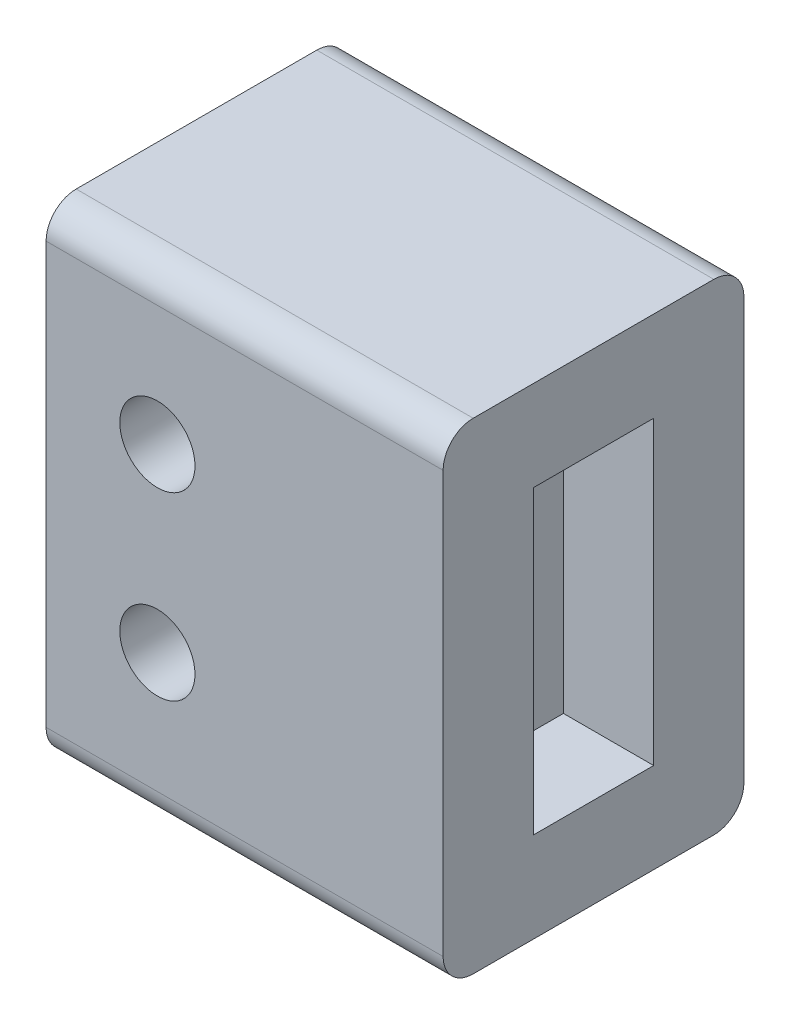
ISO-10303-21;
HEADER;
FILE_DESCRIPTION(('STEP AP214'),'2;1');
FILE_NAME('part.step','',(''),(''),'','','');
FILE_SCHEMA(('AUTOMOTIVE_DESIGN { 1 0 10303 214 1 1 1 1 }'));
ENDSEC;
DATA;
#1=APPLICATION_CONTEXT('core data for automotive mechanical design processes');
#2=APPLICATION_PROTOCOL_DEFINITION('international standard','automotive_design',2000,#1);
#3=PRODUCT_CONTEXT('',#1,'mechanical');
#4=PRODUCT('Part','Part','',(#3));
#5=PRODUCT_RELATED_PRODUCT_CATEGORY('part','',(#4));
#6=PRODUCT_DEFINITION_FORMATION('','',#4);
#7=PRODUCT_DEFINITION_CONTEXT('part definition',#1,'design');
#8=PRODUCT_DEFINITION('design','',#6,#7);
#9=PRODUCT_DEFINITION_SHAPE('','',#8);
#10=(LENGTH_UNIT() NAMED_UNIT(*) SI_UNIT(.MILLI.,.METRE.));
#11=(NAMED_UNIT(*) PLANE_ANGLE_UNIT() SI_UNIT($,.RADIAN.));
#12=(NAMED_UNIT(*) SI_UNIT($,.STERADIAN.) SOLID_ANGLE_UNIT());
#13=UNCERTAINTY_MEASURE_WITH_UNIT(LENGTH_MEASURE(1.E-05),#10,'distance_accuracy_value','');
#14=(GEOMETRIC_REPRESENTATION_CONTEXT(3) GLOBAL_UNCERTAINTY_ASSIGNED_CONTEXT((#13)) GLOBAL_UNIT_ASSIGNED_CONTEXT((#10,
#11,#12)) REPRESENTATION_CONTEXT('',''));
#15=CARTESIAN_POINT('',(0.,0.,0.));
#16=DIRECTION('',(0.,0.,1.));
#17=DIRECTION('',(1.,0.,0.));
#18=AXIS2_PLACEMENT_3D('',#15,#16,#17);
#19=CARTESIAN_POINT('',(16.3,6.,6.));
#20=DIRECTION('',(1.,0.,0.));
#21=DIRECTION('',(0.,0.,-1.));
#22=AXIS2_PLACEMENT_3D('',#19,#20,#21);
#23=PLANE('',#22);
#24=DIRECTION('',(0.,-1.,0.));
#25=VECTOR('',#24,1.);
#26=CARTESIAN_POINT('',(16.3,6.,-2.));
#27=LINE('',#26,#25);
#28=CARTESIAN_POINT('',(16.3,7.,-2.));
#29=VERTEX_POINT('',#28);
#30=CARTESIAN_POINT('',(16.3,-7.,-2.));
#31=VERTEX_POINT('',#30);
#32=EDGE_CURVE('E258',#29,#31,#27,.T.);
#33=ORIENTED_EDGE('',*,*,#32,.T.);
#34=CARTESIAN_POINT('',(16.3,-7.,-1.));
#35=DIRECTION('',(1.,0.,0.));
#36=DIRECTION('',(0.,0.,-1.));
#37=AXIS2_PLACEMENT_3D('',#34,#35,#36);
#38=CIRCLE('',#37,1.);
#39=CARTESIAN_POINT('',(16.3,-8.,-1.));
#40=VERTEX_POINT('',#39);
#41=EDGE_CURVE('E294',#31,#40,#38,.F.);
#42=ORIENTED_EDGE('',*,*,#41,.T.);
#43=DIRECTION('',(0.,0.,-1.));
#44=VECTOR('',#43,1.);
#45=CARTESIAN_POINT('',(16.3,-8.,6.));
#46=LINE('',#45,#44);
#47=CARTESIAN_POINT('',(16.3,-8.,7.));
#48=VERTEX_POINT('',#47);
#49=EDGE_CURVE('E262',#48,#40,#46,.T.);
#50=ORIENTED_EDGE('',*,*,#49,.F.);
#51=CARTESIAN_POINT('',(16.3,-7.,7.));
#52=DIRECTION('',(1.,0.,0.));
#53=DIRECTION('',(0.,0.,-1.));
#54=AXIS2_PLACEMENT_3D('',#51,#52,#53);
#55=CIRCLE('',#54,1.);
#56=CARTESIAN_POINT('',(16.3,-7.,8.));
#57=VERTEX_POINT('',#56);
#58=EDGE_CURVE('E292',#48,#57,#55,.F.);
#59=ORIENTED_EDGE('',*,*,#58,.T.);
#60=DIRECTION('',(0.,-1.,0.));
#61=VECTOR('',#60,1.);
#62=CARTESIAN_POINT('',(16.3,6.,8.));
#63=LINE('',#62,#61);
#64=CARTESIAN_POINT('',(16.3,7.,8.));
#65=VERTEX_POINT('',#64);
#66=EDGE_CURVE('E265',#65,#57,#63,.T.);
#67=ORIENTED_EDGE('',*,*,#66,.F.);
#68=CARTESIAN_POINT('',(16.3,7.,7.));
#69=DIRECTION('',(1.,0.,0.));
#70=DIRECTION('',(0.,0.,-1.));
#71=AXIS2_PLACEMENT_3D('',#68,#69,#70);
#72=CIRCLE('',#71,1.);
#73=CARTESIAN_POINT('',(16.3,8.,7.));
#74=VERTEX_POINT('',#73);
#75=EDGE_CURVE('E62',#65,#74,#72,.F.);
#76=ORIENTED_EDGE('',*,*,#75,.T.);
#77=DIRECTION('',(0.,0.,-1.));
#78=VECTOR('',#77,1.);
#79=CARTESIAN_POINT('',(16.3,8.,6.));
#80=LINE('',#79,#78);
#81=CARTESIAN_POINT('',(16.3,8.,-1.));
#82=VERTEX_POINT('',#81);
#83=EDGE_CURVE('E259',#74,#82,#80,.T.);
#84=ORIENTED_EDGE('',*,*,#83,.T.);
#85=CARTESIAN_POINT('',(16.3,7.,-1.));
#86=DIRECTION('',(1.,0.,0.));
#87=DIRECTION('',(0.,0.,-1.));
#88=AXIS2_PLACEMENT_3D('',#85,#86,#87);
#89=CIRCLE('',#88,1.);
#90=EDGE_CURVE('E54',#82,#29,#89,.F.);
#91=ORIENTED_EDGE('',*,*,#90,.T.);
#92=EDGE_LOOP('',(#33,#42,#50,#59,#67,#76,#84,#91));
#93=FACE_BOUND('',#92,.T.);
#94=DIRECTION('',(0.,-1.,0.));
#95=VECTOR('',#94,1.);
#96=CARTESIAN_POINT('',(16.3,6.,0.));
#97=LINE('',#96,#95);
#98=CARTESIAN_POINT('',(16.3,6.,0.));
#99=VERTEX_POINT('',#98);
#100=CARTESIAN_POINT('',(16.3,-6.,0.));
#101=VERTEX_POINT('',#100);
#102=EDGE_CURVE('E244',#99,#101,#97,.T.);
#103=ORIENTED_EDGE('',*,*,#102,.F.);
#104=DIRECTION('',(0.,0.,-1.));
#105=VECTOR('',#104,1.);
#106=CARTESIAN_POINT('',(16.3,6.,6.));
#107=LINE('',#106,#105);
#108=CARTESIAN_POINT('',(16.3,6.,6.));
#109=VERTEX_POINT('',#108);
#110=EDGE_CURVE('E252',#109,#99,#107,.T.);
#111=ORIENTED_EDGE('',*,*,#110,.F.);
#112=DIRECTION('',(0.,-1.,0.));
#113=VECTOR('',#112,1.);
#114=CARTESIAN_POINT('',(16.3,6.,6.));
#115=LINE('',#114,#113);
#116=CARTESIAN_POINT('',(16.3,-6.,6.));
#117=VERTEX_POINT('',#116);
#118=EDGE_CURVE('E234',#109,#117,#115,.T.);
#119=ORIENTED_EDGE('',*,*,#118,.T.);
#120=DIRECTION('',(0.,0.,-1.));
#121=VECTOR('',#120,1.);
#122=CARTESIAN_POINT('',(16.3,-6.,6.));
#123=LINE('',#122,#121);
#124=EDGE_CURVE('E249',#117,#101,#123,.T.);
#125=ORIENTED_EDGE('',*,*,#124,.T.);
#126=EDGE_LOOP('',(#103,#111,#119,#125));
#127=FACE_BOUND('',#126,.T.);
#128=ADVANCED_FACE('F39',(#93,#127),#23,.F.);
#129=CARTESIAN_POINT('',(23.5,8.,6.));
#130=DIRECTION('',(0.,-1.,0.));
#131=DIRECTION('',(1.,0.,0.));
#132=AXIS2_PLACEMENT_3D('',#129,#130,#131);
#133=PLANE('',#132);
#134=ORIENTED_EDGE('',*,*,#83,.F.);
#135=DIRECTION('',(-1.,0.,0.));
#136=VECTOR('',#135,1.);
#137=CARTESIAN_POINT('',(29.5,8.,7.));
#138=LINE('',#137,#136);
#139=CARTESIAN_POINT('',(29.5,8.,7.));
#140=VERTEX_POINT('',#139);
#141=EDGE_CURVE('E11',#74,#140,#138,.F.);
#142=ORIENTED_EDGE('',*,*,#141,.T.);
#143=DIRECTION('',(0.,0.,1.));
#144=VECTOR('',#143,1.);
#145=CARTESIAN_POINT('',(29.5,8.,8.));
#146=LINE('',#145,#144);
#147=CARTESIAN_POINT('',(29.5,8.,-1.));
#148=VERTEX_POINT('',#147);
#149=EDGE_CURVE('E203',#148,#140,#146,.T.);
#150=ORIENTED_EDGE('',*,*,#149,.F.);
#151=DIRECTION('',(-1.,0.,0.));
#152=VECTOR('',#151,1.);
#153=CARTESIAN_POINT('',(23.5,8.,-1.));
#154=LINE('',#153,#152);
#155=EDGE_CURVE('E47',#148,#82,#154,.T.);
#156=ORIENTED_EDGE('',*,*,#155,.T.);
#157=EDGE_LOOP('',(#134,#142,#150,#156));
#158=FACE_BOUND('',#157,.T.);
#159=ADVANCED_FACE('F303',(#158),#133,.F.);
#160=CARTESIAN_POINT('',(16.3,-8.,6.));
#161=DIRECTION('',(0.,1.,0.));
#162=DIRECTION('',(-1.,0.,0.));
#163=AXIS2_PLACEMENT_3D('',#160,#161,#162);
#164=PLANE('',#163);
#165=ORIENTED_EDGE('',*,*,#49,.T.);
#166=DIRECTION('',(1.,0.,0.));
#167=VECTOR('',#166,1.);
#168=CARTESIAN_POINT('',(16.3,-8.,-1.));
#169=LINE('',#168,#167);
#170=CARTESIAN_POINT('',(29.5,-8.,-1.));
#171=VERTEX_POINT('',#170);
#172=EDGE_CURVE('E275',#40,#171,#169,.T.);
#173=ORIENTED_EDGE('',*,*,#172,.T.);
#174=DIRECTION('',(0.,0.,-1.));
#175=VECTOR('',#174,1.);
#176=CARTESIAN_POINT('',(29.5,-8.,8.));
#177=LINE('',#176,#175);
#178=CARTESIAN_POINT('',(29.5,-8.,7.));
#179=VERTEX_POINT('',#178);
#180=EDGE_CURVE('E197',#179,#171,#177,.T.);
#181=ORIENTED_EDGE('',*,*,#180,.F.);
#182=DIRECTION('',(1.,0.,0.));
#183=VECTOR('',#182,1.);
#184=CARTESIAN_POINT('',(16.3,-8.,7.));
#185=LINE('',#184,#183);
#186=EDGE_CURVE('E261',#179,#48,#185,.F.);
#187=ORIENTED_EDGE('',*,*,#186,.T.);
#188=EDGE_LOOP('',(#165,#173,#181,#187));
#189=FACE_BOUND('',#188,.T.);
#190=ADVANCED_FACE('F320',(#189),#164,.F.);
#191=CARTESIAN_POINT('',(0.,0.,8.));
#192=DIRECTION('',(0.,0.,1.));
#193=DIRECTION('',(1.,0.,0.));
#194=AXIS2_PLACEMENT_3D('',#191,#192,#193);
#195=PLANE('',#194);
#196=CARTESIAN_POINT('',(20.,-3.,8.));
#197=DIRECTION('',(0.,0.,1.));
#198=DIRECTION('',(1.,0.,0.));
#199=AXIS2_PLACEMENT_3D('',#196,#197,#198);
#200=CIRCLE('',#199,1.25);
#201=CARTESIAN_POINT('',(21.25,-3.,8.));
#202=VERTEX_POINT('',#201);
#203=EDGE_CURVE('E207',#202,#202,#200,.T.);
#204=ORIENTED_EDGE('',*,*,#203,.F.);
#205=EDGE_LOOP('',(#204));
#206=FACE_BOUND('',#205,.T.);
#207=CARTESIAN_POINT('',(20.,3.,8.));
#208=DIRECTION('',(0.,0.,1.));
#209=DIRECTION('',(1.,0.,0.));
#210=AXIS2_PLACEMENT_3D('',#207,#208,#209);
#211=CIRCLE('',#210,1.25);
#212=CARTESIAN_POINT('',(21.25,3.,8.));
#213=VERTEX_POINT('',#212);
#214=EDGE_CURVE('E206',#213,#213,#211,.T.);
#215=ORIENTED_EDGE('',*,*,#214,.F.);
#216=EDGE_LOOP('',(#215));
#217=FACE_BOUND('',#216,.T.);
#218=ORIENTED_EDGE('',*,*,#66,.T.);
#219=DIRECTION('',(1.,0.,0.));
#220=VECTOR('',#219,1.);
#221=CARTESIAN_POINT('',(29.5,-7.,8.));
#222=LINE('',#221,#220);
#223=CARTESIAN_POINT('',(29.5,-7.,8.));
#224=VERTEX_POINT('',#223);
#225=EDGE_CURVE('E299',#57,#224,#222,.T.);
#226=ORIENTED_EDGE('',*,*,#225,.T.);
#227=DIRECTION('',(0.,-1.,0.));
#228=VECTOR('',#227,1.);
#229=CARTESIAN_POINT('',(29.5,8.,8.));
#230=LINE('',#229,#228);
#231=CARTESIAN_POINT('',(29.5,7.,8.));
#232=VERTEX_POINT('',#231);
#233=EDGE_CURVE('E194',#232,#224,#230,.T.);
#234=ORIENTED_EDGE('',*,*,#233,.F.);
#235=DIRECTION('',(-1.,0.,0.));
#236=VECTOR('',#235,1.);
#237=CARTESIAN_POINT('',(16.3,7.,8.));
#238=LINE('',#237,#236);
#239=EDGE_CURVE('E296',#232,#65,#238,.T.);
#240=ORIENTED_EDGE('',*,*,#239,.T.);
#241=EDGE_LOOP('',(#218,#226,#234,#240));
#242=FACE_BOUND('',#241,.T.);
#243=ADVANCED_FACE('F327',(#206,#217,#242),#195,.T.);
#244=CARTESIAN_POINT('',(0.,0.,-2.));
#245=DIRECTION('',(0.,0.,1.));
#246=DIRECTION('',(1.,0.,0.));
#247=AXIS2_PLACEMENT_3D('',#244,#245,#246);
#248=PLANE('',#247);
#249=CARTESIAN_POINT('',(20.,-3.,-2.));
#250=DIRECTION('',(0.,0.,1.));
#251=DIRECTION('',(1.,0.,0.));
#252=AXIS2_PLACEMENT_3D('',#249,#250,#251);
#253=CIRCLE('',#252,1.25);
#254=CARTESIAN_POINT('',(21.25,-3.,-2.));
#255=VERTEX_POINT('',#254);
#256=EDGE_CURVE('E210',#255,#255,#253,.T.);
#257=ORIENTED_EDGE('',*,*,#256,.T.);
#258=EDGE_LOOP('',(#257));
#259=FACE_BOUND('',#258,.T.);
#260=CARTESIAN_POINT('',(20.,3.,-2.));
#261=DIRECTION('',(0.,0.,1.));
#262=DIRECTION('',(1.,0.,0.));
#263=AXIS2_PLACEMENT_3D('',#260,#261,#262);
#264=CIRCLE('',#263,1.25);
#265=CARTESIAN_POINT('',(21.25,3.,-2.));
#266=VERTEX_POINT('',#265);
#267=EDGE_CURVE('E211',#266,#266,#264,.T.);
#268=ORIENTED_EDGE('',*,*,#267,.T.);
#269=EDGE_LOOP('',(#268));
#270=FACE_BOUND('',#269,.T.);
#271=DIRECTION('',(0.,1.,0.));
#272=VECTOR('',#271,1.);
#273=CARTESIAN_POINT('',(29.5,8.,-2.));
#274=LINE('',#273,#272);
#275=CARTESIAN_POINT('',(29.5,-7.,-2.));
#276=VERTEX_POINT('',#275);
#277=CARTESIAN_POINT('',(29.5,7.,-2.));
#278=VERTEX_POINT('',#277);
#279=EDGE_CURVE('E200',#276,#278,#274,.T.);
#280=ORIENTED_EDGE('',*,*,#279,.F.);
#281=DIRECTION('',(1.,0.,0.));
#282=VECTOR('',#281,1.);
#283=CARTESIAN_POINT('',(0.,-7.,-2.));
#284=LINE('',#283,#282);
#285=EDGE_CURVE('E288',#276,#31,#284,.F.);
#286=ORIENTED_EDGE('',*,*,#285,.T.);
#287=ORIENTED_EDGE('',*,*,#32,.F.);
#288=DIRECTION('',(-1.,0.,0.));
#289=VECTOR('',#288,1.);
#290=CARTESIAN_POINT('',(0.,7.,-2.));
#291=LINE('',#290,#289);
#292=EDGE_CURVE('E286',#29,#278,#291,.F.);
#293=ORIENTED_EDGE('',*,*,#292,.T.);
#294=EDGE_LOOP('',(#280,#286,#287,#293));
#295=FACE_BOUND('',#294,.T.);
#296=ADVANCED_FACE('F311',(#259,#270,#295),#248,.F.);
#297=CARTESIAN_POINT('',(23.5,-6.,6.));
#298=DIRECTION('',(-1.,0.,0.));
#299=DIRECTION('',(0.,0.,1.));
#300=AXIS2_PLACEMENT_3D('',#297,#298,#299);
#301=PLANE('',#300);
#302=DIRECTION('',(0.,1.,0.));
#303=VECTOR('',#302,1.);
#304=CARTESIAN_POINT('',(23.5,-6.,0.));
#305=LINE('',#304,#303);
#306=CARTESIAN_POINT('',(23.5,-6.,0.));
#307=VERTEX_POINT('',#306);
#308=CARTESIAN_POINT('',(23.5,6.,0.));
#309=VERTEX_POINT('',#308);
#310=EDGE_CURVE('E226',#307,#309,#305,.T.);
#311=ORIENTED_EDGE('',*,*,#310,.F.);
#312=DIRECTION('',(0.,0.,-1.));
#313=VECTOR('',#312,1.);
#314=CARTESIAN_POINT('',(23.5,-6.,6.));
#315=LINE('',#314,#313);
#316=CARTESIAN_POINT('',(23.5,-6.,6.));
#317=VERTEX_POINT('',#316);
#318=EDGE_CURVE('E239',#317,#307,#315,.T.);
#319=ORIENTED_EDGE('',*,*,#318,.F.);
#320=DIRECTION('',(0.,1.,0.));
#321=VECTOR('',#320,1.);
#322=CARTESIAN_POINT('',(23.5,-6.,6.));
#323=LINE('',#322,#321);
#324=CARTESIAN_POINT('',(23.5,6.,6.));
#325=VERTEX_POINT('',#324);
#326=EDGE_CURVE('E227',#317,#325,#323,.T.);
#327=ORIENTED_EDGE('',*,*,#326,.T.);
#328=DIRECTION('',(0.,0.,-1.));
#329=VECTOR('',#328,1.);
#330=CARTESIAN_POINT('',(23.5,6.,6.));
#331=LINE('',#330,#329);
#332=EDGE_CURVE('E255',#325,#309,#331,.T.);
#333=ORIENTED_EDGE('',*,*,#332,.T.);
#334=EDGE_LOOP('',(#311,#319,#327,#333));
#335=FACE_BOUND('',#334,.T.);
#336=ADVANCED_FACE('F345',(#335),#301,.T.);
#337=CARTESIAN_POINT('',(23.5,6.,6.));
#338=DIRECTION('',(0.,-1.,0.));
#339=DIRECTION('',(1.,0.,0.));
#340=AXIS2_PLACEMENT_3D('',#337,#338,#339);
#341=PLANE('',#340);
#342=DIRECTION('',(-1.,0.,0.));
#343=VECTOR('',#342,1.);
#344=CARTESIAN_POINT('',(23.5,6.,0.));
#345=LINE('',#344,#343);
#346=EDGE_CURVE('E242',#309,#99,#345,.T.);
#347=ORIENTED_EDGE('',*,*,#346,.F.);
#348=ORIENTED_EDGE('',*,*,#332,.F.);
#349=DIRECTION('',(-1.,0.,0.));
#350=VECTOR('',#349,1.);
#351=CARTESIAN_POINT('',(23.5,6.,6.));
#352=LINE('',#351,#350);
#353=EDGE_CURVE('E230',#325,#109,#352,.T.);
#354=ORIENTED_EDGE('',*,*,#353,.T.);
#355=ORIENTED_EDGE('',*,*,#110,.T.);
#356=EDGE_LOOP('',(#347,#348,#354,#355));
#357=FACE_BOUND('',#356,.T.);
#358=ADVANCED_FACE('F393',(#357),#341,.T.);
#359=CARTESIAN_POINT('',(16.3,-6.,6.));
#360=DIRECTION('',(0.,1.,0.));
#361=DIRECTION('',(-1.,0.,0.));
#362=AXIS2_PLACEMENT_3D('',#359,#360,#361);
#363=PLANE('',#362);
#364=DIRECTION('',(1.,0.,0.));
#365=VECTOR('',#364,1.);
#366=CARTESIAN_POINT('',(16.3,-6.,0.));
#367=LINE('',#366,#365);
#368=EDGE_CURVE('E231',#101,#307,#367,.T.);
#369=ORIENTED_EDGE('',*,*,#368,.F.);
#370=ORIENTED_EDGE('',*,*,#124,.F.);
#371=DIRECTION('',(1.,0.,0.));
#372=VECTOR('',#371,1.);
#373=CARTESIAN_POINT('',(16.3,-6.,6.));
#374=LINE('',#373,#372);
#375=EDGE_CURVE('E237',#117,#317,#374,.T.);
#376=ORIENTED_EDGE('',*,*,#375,.T.);
#377=ORIENTED_EDGE('',*,*,#318,.T.);
#378=EDGE_LOOP('',(#369,#370,#376,#377));
#379=FACE_BOUND('',#378,.T.);
#380=ADVANCED_FACE('F387',(#379),#363,.T.);
#381=CARTESIAN_POINT('',(0.,0.,6.));
#382=DIRECTION('',(0.,0.,1.));
#383=DIRECTION('',(1.,0.,0.));
#384=AXIS2_PLACEMENT_3D('',#381,#382,#383);
#385=PLANE('',#384);
#386=CARTESIAN_POINT('',(20.,-3.,6.));
#387=DIRECTION('',(0.,0.,1.));
#388=DIRECTION('',(1.,0.,0.));
#389=AXIS2_PLACEMENT_3D('',#386,#387,#388);
#390=CIRCLE('',#389,1.25);
#391=CARTESIAN_POINT('',(21.25,-3.,6.));
#392=VERTEX_POINT('',#391);
#393=EDGE_CURVE('E223',#392,#392,#390,.T.);
#394=ORIENTED_EDGE('',*,*,#393,.T.);
#395=EDGE_LOOP('',(#394));
#396=FACE_BOUND('',#395,.T.);
#397=CARTESIAN_POINT('',(20.,3.,6.));
#398=DIRECTION('',(0.,0.,1.));
#399=DIRECTION('',(1.,0.,0.));
#400=AXIS2_PLACEMENT_3D('',#397,#398,#399);
#401=CIRCLE('',#400,1.25);
#402=CARTESIAN_POINT('',(21.25,3.,6.));
#403=VERTEX_POINT('',#402);
#404=EDGE_CURVE('E219',#403,#403,#401,.T.);
#405=ORIENTED_EDGE('',*,*,#404,.T.);
#406=EDGE_LOOP('',(#405));
#407=FACE_BOUND('',#406,.T.);
#408=ORIENTED_EDGE('',*,*,#326,.F.);
#409=ORIENTED_EDGE('',*,*,#375,.F.);
#410=ORIENTED_EDGE('',*,*,#118,.F.);
#411=ORIENTED_EDGE('',*,*,#353,.F.);
#412=EDGE_LOOP('',(#408,#409,#410,#411));
#413=FACE_BOUND('',#412,.T.);
#414=ADVANCED_FACE('F384',(#396,#407,#413),#385,.F.);
#415=CARTESIAN_POINT('',(0.,0.,0.));
#416=DIRECTION('',(0.,0.,1.));
#417=DIRECTION('',(1.,0.,0.));
#418=AXIS2_PLACEMENT_3D('',#415,#416,#417);
#419=PLANE('',#418);
#420=CARTESIAN_POINT('',(20.,-3.,0.));
#421=DIRECTION('',(0.,0.,1.));
#422=DIRECTION('',(1.,0.,0.));
#423=AXIS2_PLACEMENT_3D('',#420,#421,#422);
#424=CIRCLE('',#423,1.25);
#425=CARTESIAN_POINT('',(21.25,-3.,0.));
#426=VERTEX_POINT('',#425);
#427=EDGE_CURVE('E222',#426,#426,#424,.T.);
#428=ORIENTED_EDGE('',*,*,#427,.F.);
#429=EDGE_LOOP('',(#428));
#430=FACE_BOUND('',#429,.T.);
#431=CARTESIAN_POINT('',(20.,3.,0.));
#432=DIRECTION('',(0.,0.,1.));
#433=DIRECTION('',(1.,0.,0.));
#434=AXIS2_PLACEMENT_3D('',#431,#432,#433);
#435=CIRCLE('',#434,1.25);
#436=CARTESIAN_POINT('',(21.25,3.,0.));
#437=VERTEX_POINT('',#436);
#438=EDGE_CURVE('E214',#437,#437,#435,.T.);
#439=ORIENTED_EDGE('',*,*,#438,.F.);
#440=EDGE_LOOP('',(#439));
#441=FACE_BOUND('',#440,.T.);
#442=ORIENTED_EDGE('',*,*,#310,.T.);
#443=ORIENTED_EDGE('',*,*,#346,.T.);
#444=ORIENTED_EDGE('',*,*,#102,.T.);
#445=ORIENTED_EDGE('',*,*,#368,.T.);
#446=EDGE_LOOP('',(#442,#443,#444,#445));
#447=FACE_BOUND('',#446,.T.);
#448=ADVANCED_FACE('F382',(#430,#441,#447),#419,.T.);
#449=CARTESIAN_POINT('',(20.,3.,-2.));
#450=DIRECTION('',(0.,0.,1.));
#451=DIRECTION('',(1.,0.,0.));
#452=AXIS2_PLACEMENT_3D('',#449,#450,#451);
#453=CYLINDRICAL_SURFACE('',#452,1.25);
#454=ORIENTED_EDGE('',*,*,#438,.T.);
#455=EDGE_LOOP('',(#454));
#456=FACE_BOUND('',#455,.T.);
#457=ORIENTED_EDGE('',*,*,#267,.F.);
#458=EDGE_LOOP('',(#457));
#459=FACE_BOUND('',#458,.T.);
#460=ADVANCED_FACE('F378',(#456,#459),#453,.F.);
#461=CARTESIAN_POINT('',(20.,-3.,-2.));
#462=DIRECTION('',(0.,0.,1.));
#463=DIRECTION('',(1.,0.,0.));
#464=AXIS2_PLACEMENT_3D('',#461,#462,#463);
#465=CYLINDRICAL_SURFACE('',#464,1.25);
#466=ORIENTED_EDGE('',*,*,#427,.T.);
#467=EDGE_LOOP('',(#466));
#468=FACE_BOUND('',#467,.T.);
#469=ORIENTED_EDGE('',*,*,#256,.F.);
#470=EDGE_LOOP('',(#469));
#471=FACE_BOUND('',#470,.T.);
#472=ADVANCED_FACE('F374',(#468,#471),#465,.F.);
#473=ORIENTED_EDGE('',*,*,#214,.T.);
#474=EDGE_LOOP('',(#473));
#475=FACE_BOUND('',#474,.T.);
#476=ORIENTED_EDGE('',*,*,#404,.F.);
#477=EDGE_LOOP('',(#476));
#478=FACE_BOUND('',#477,.T.);
#479=ADVANCED_FACE('F377',(#475,#478),#453,.F.);
#480=ORIENTED_EDGE('',*,*,#203,.T.);
#481=EDGE_LOOP('',(#480));
#482=FACE_BOUND('',#481,.T.);
#483=ORIENTED_EDGE('',*,*,#393,.F.);
#484=EDGE_LOOP('',(#483));
#485=FACE_BOUND('',#484,.T.);
#486=ADVANCED_FACE('F373',(#482,#485),#465,.F.);
#487=CARTESIAN_POINT('',(29.5,0.,0.));
#488=DIRECTION('',(1.,0.,0.));
#489=DIRECTION('',(0.,0.,-1.));
#490=AXIS2_PLACEMENT_3D('',#487,#488,#489);
#491=PLANE('',#490);
#492=DIRECTION('',(0.,-1.,0.));
#493=VECTOR('',#492,1.);
#494=CARTESIAN_POINT('',(29.5,0.,5.));
#495=LINE('',#494,#493);
#496=CARTESIAN_POINT('',(29.5,5.,5.));
#497=VERTEX_POINT('',#496);
#498=CARTESIAN_POINT('',(29.5,-5.,5.));
#499=VERTEX_POINT('',#498);
#500=EDGE_CURVE('E158',#497,#499,#495,.T.);
#501=ORIENTED_EDGE('',*,*,#500,.F.);
#502=DIRECTION('',(0.,0.,1.));
#503=VECTOR('',#502,1.);
#504=CARTESIAN_POINT('',(29.5,5.,6.));
#505=LINE('',#504,#503);
#506=CARTESIAN_POINT('',(29.5,5.,1.));
#507=VERTEX_POINT('',#506);
#508=EDGE_CURVE('E169',#507,#497,#505,.T.);
#509=ORIENTED_EDGE('',*,*,#508,.F.);
#510=DIRECTION('',(0.,1.,0.));
#511=VECTOR('',#510,1.);
#512=CARTESIAN_POINT('',(29.5,0.,1.));
#513=LINE('',#512,#511);
#514=CARTESIAN_POINT('',(29.5,-5.,1.));
#515=VERTEX_POINT('',#514);
#516=EDGE_CURVE('E175',#515,#507,#513,.T.);
#517=ORIENTED_EDGE('',*,*,#516,.F.);
#518=DIRECTION('',(0.,0.,-1.));
#519=VECTOR('',#518,1.);
#520=CARTESIAN_POINT('',(29.5,-5.,6.));
#521=LINE('',#520,#519);
#522=EDGE_CURVE('E180',#499,#515,#521,.T.);
#523=ORIENTED_EDGE('',*,*,#522,.F.);
#524=EDGE_LOOP('',(#501,#509,#517,#523));
#525=FACE_BOUND('',#524,.T.);
#526=ORIENTED_EDGE('',*,*,#180,.T.);
#527=CARTESIAN_POINT('',(29.5,-7.,-1.));
#528=DIRECTION('',(1.,0.,0.));
#529=DIRECTION('',(0.,0.,-1.));
#530=AXIS2_PLACEMENT_3D('',#527,#528,#529);
#531=CIRCLE('',#530,1.);
#532=EDGE_CURVE('E284',#171,#276,#531,.T.);
#533=ORIENTED_EDGE('',*,*,#532,.T.);
#534=ORIENTED_EDGE('',*,*,#279,.T.);
#535=CARTESIAN_POINT('',(29.5,7.,-1.));
#536=DIRECTION('',(1.,0.,0.));
#537=DIRECTION('',(0.,0.,-1.));
#538=AXIS2_PLACEMENT_3D('',#535,#536,#537);
#539=CIRCLE('',#538,1.);
#540=EDGE_CURVE('E278',#278,#148,#539,.T.);
#541=ORIENTED_EDGE('',*,*,#540,.T.);
#542=ORIENTED_EDGE('',*,*,#149,.T.);
#543=CARTESIAN_POINT('',(29.5,7.,7.));
#544=DIRECTION('',(1.,0.,0.));
#545=DIRECTION('',(0.,0.,-1.));
#546=AXIS2_PLACEMENT_3D('',#543,#544,#545);
#547=CIRCLE('',#546,1.);
#548=EDGE_CURVE('E280',#140,#232,#547,.T.);
#549=ORIENTED_EDGE('',*,*,#548,.T.);
#550=ORIENTED_EDGE('',*,*,#233,.T.);
#551=CARTESIAN_POINT('',(29.5,-7.,7.));
#552=DIRECTION('',(1.,0.,0.));
#553=DIRECTION('',(0.,0.,-1.));
#554=AXIS2_PLACEMENT_3D('',#551,#552,#553);
#555=CIRCLE('',#554,1.);
#556=EDGE_CURVE('E282',#224,#179,#555,.T.);
#557=ORIENTED_EDGE('',*,*,#556,.T.);
#558=EDGE_LOOP('',(#526,#533,#534,#541,#542,#549,#550,#557));
#559=FACE_BOUND('',#558,.T.);
#560=ADVANCED_FACE('F177',(#525,#559),#491,.T.);
#561=CARTESIAN_POINT('',(23.5,5.,6.));
#562=DIRECTION('',(0.,-1.,0.));
#563=DIRECTION('',(1.,0.,0.));
#564=AXIS2_PLACEMENT_3D('',#561,#562,#563);
#565=PLANE('',#564);
#566=DIRECTION('',(0.,0.,-1.));
#567=VECTOR('',#566,1.);
#568=CARTESIAN_POINT('',(26.5,5.,6.));
#569=LINE('',#568,#567);
#570=CARTESIAN_POINT('',(26.5,5.,5.));
#571=VERTEX_POINT('',#570);
#572=CARTESIAN_POINT('',(26.5,5.,1.));
#573=VERTEX_POINT('',#572);
#574=EDGE_CURVE('E189',#571,#573,#569,.T.);
#575=ORIENTED_EDGE('',*,*,#574,.T.);
#576=DIRECTION('',(-1.,0.,0.));
#577=VECTOR('',#576,1.);
#578=CARTESIAN_POINT('',(23.5,5.,1.));
#579=LINE('',#578,#577);
#580=EDGE_CURVE('E172',#507,#573,#579,.T.);
#581=ORIENTED_EDGE('',*,*,#580,.F.);
#582=ORIENTED_EDGE('',*,*,#508,.T.);
#583=DIRECTION('',(-1.,0.,0.));
#584=VECTOR('',#583,1.);
#585=CARTESIAN_POINT('',(23.5,5.,5.));
#586=LINE('',#585,#584);
#587=EDGE_CURVE('E153',#497,#571,#586,.T.);
#588=ORIENTED_EDGE('',*,*,#587,.T.);
#589=EDGE_LOOP('',(#575,#581,#582,#588));
#590=FACE_BOUND('',#589,.T.);
#591=ADVANCED_FACE('F170',(#590),#565,.T.);
#592=CARTESIAN_POINT('',(16.3,-5.,6.));
#593=DIRECTION('',(0.,1.,0.));
#594=DIRECTION('',(-1.,0.,0.));
#595=AXIS2_PLACEMENT_3D('',#592,#593,#594);
#596=PLANE('',#595);
#597=DIRECTION('',(0.,0.,1.));
#598=VECTOR('',#597,1.);
#599=CARTESIAN_POINT('',(26.5,-5.,6.));
#600=LINE('',#599,#598);
#601=CARTESIAN_POINT('',(26.5,-5.,1.));
#602=VERTEX_POINT('',#601);
#603=CARTESIAN_POINT('',(26.5,-5.,5.));
#604=VERTEX_POINT('',#603);
#605=EDGE_CURVE('E186',#602,#604,#600,.T.);
#606=ORIENTED_EDGE('',*,*,#605,.T.);
#607=DIRECTION('',(1.,0.,0.));
#608=VECTOR('',#607,1.);
#609=CARTESIAN_POINT('',(16.3,-5.,5.));
#610=LINE('',#609,#608);
#611=EDGE_CURVE('E164',#604,#499,#610,.T.);
#612=ORIENTED_EDGE('',*,*,#611,.T.);
#613=ORIENTED_EDGE('',*,*,#522,.T.);
#614=DIRECTION('',(1.,0.,0.));
#615=VECTOR('',#614,1.);
#616=CARTESIAN_POINT('',(16.3,-5.,1.));
#617=LINE('',#616,#615);
#618=EDGE_CURVE('E165',#602,#515,#617,.T.);
#619=ORIENTED_EDGE('',*,*,#618,.F.);
#620=EDGE_LOOP('',(#606,#612,#613,#619));
#621=FACE_BOUND('',#620,.T.);
#622=ADVANCED_FACE('F457',(#621),#596,.T.);
#623=CARTESIAN_POINT('',(0.,0.,5.));
#624=DIRECTION('',(0.,0.,1.));
#625=DIRECTION('',(1.,0.,0.));
#626=AXIS2_PLACEMENT_3D('',#623,#624,#625);
#627=PLANE('',#626);
#628=ORIENTED_EDGE('',*,*,#587,.F.);
#629=ORIENTED_EDGE('',*,*,#500,.T.);
#630=ORIENTED_EDGE('',*,*,#611,.F.);
#631=DIRECTION('',(0.,-1.,0.));
#632=VECTOR('',#631,1.);
#633=CARTESIAN_POINT('',(26.5,0.,5.));
#634=LINE('',#633,#632);
#635=EDGE_CURVE('E160',#571,#604,#634,.T.);
#636=ORIENTED_EDGE('',*,*,#635,.F.);
#637=EDGE_LOOP('',(#628,#629,#630,#636));
#638=FACE_BOUND('',#637,.T.);
#639=ADVANCED_FACE('F155',(#638),#627,.F.);
#640=CARTESIAN_POINT('',(0.,0.,1.));
#641=DIRECTION('',(0.,0.,1.));
#642=DIRECTION('',(1.,0.,0.));
#643=AXIS2_PLACEMENT_3D('',#640,#641,#642);
#644=PLANE('',#643);
#645=DIRECTION('',(0.,-1.,0.));
#646=VECTOR('',#645,1.);
#647=CARTESIAN_POINT('',(26.5,0.,1.));
#648=LINE('',#647,#646);
#649=EDGE_CURVE('E191',#573,#602,#648,.T.);
#650=ORIENTED_EDGE('',*,*,#649,.T.);
#651=ORIENTED_EDGE('',*,*,#618,.T.);
#652=ORIENTED_EDGE('',*,*,#516,.T.);
#653=ORIENTED_EDGE('',*,*,#580,.T.);
#654=EDGE_LOOP('',(#650,#651,#652,#653));
#655=FACE_BOUND('',#654,.T.);
#656=ADVANCED_FACE('F361',(#655),#644,.T.);
#657=CARTESIAN_POINT('',(26.5,-6.,6.));
#658=DIRECTION('',(-1.,0.,0.));
#659=DIRECTION('',(0.,0.,1.));
#660=AXIS2_PLACEMENT_3D('',#657,#658,#659);
#661=PLANE('',#660);
#662=ORIENTED_EDGE('',*,*,#635,.T.);
#663=ORIENTED_EDGE('',*,*,#605,.F.);
#664=ORIENTED_EDGE('',*,*,#649,.F.);
#665=ORIENTED_EDGE('',*,*,#574,.F.);
#666=EDGE_LOOP('',(#662,#663,#664,#665));
#667=FACE_BOUND('',#666,.T.);
#668=ADVANCED_FACE('F357',(#667),#661,.F.);
#669=CARTESIAN_POINT('',(16.3,-7.,-1.));
#670=DIRECTION('',(1.,0.,0.));
#671=DIRECTION('',(0.,1.,0.));
#672=AXIS2_PLACEMENT_3D('',#669,#670,#671);
#673=CYLINDRICAL_SURFACE('',#672,1.);
#674=ORIENTED_EDGE('',*,*,#41,.F.);
#675=ORIENTED_EDGE('',*,*,#285,.F.);
#676=ORIENTED_EDGE('',*,*,#532,.F.);
#677=ORIENTED_EDGE('',*,*,#172,.F.);
#678=EDGE_LOOP('',(#674,#675,#676,#677));
#679=FACE_BOUND('',#678,.T.);
#680=ADVANCED_FACE('F315',(#679),#673,.T.);
#681=CARTESIAN_POINT('',(0.,-7.,7.));
#682=DIRECTION('',(-1.,0.,0.));
#683=DIRECTION('',(0.,-1.,0.));
#684=AXIS2_PLACEMENT_3D('',#681,#682,#683);
#685=CYLINDRICAL_SURFACE('',#684,1.);
#686=ORIENTED_EDGE('',*,*,#58,.F.);
#687=ORIENTED_EDGE('',*,*,#186,.F.);
#688=ORIENTED_EDGE('',*,*,#556,.F.);
#689=ORIENTED_EDGE('',*,*,#225,.F.);
#690=EDGE_LOOP('',(#686,#687,#688,#689));
#691=FACE_BOUND('',#690,.T.);
#692=ADVANCED_FACE('F324',(#691),#685,.T.);
#693=CARTESIAN_POINT('',(0.,7.,7.));
#694=DIRECTION('',(1.,0.,0.));
#695=DIRECTION('',(0.,1.,0.));
#696=AXIS2_PLACEMENT_3D('',#693,#694,#695);
#697=CYLINDRICAL_SURFACE('',#696,1.);
#698=ORIENTED_EDGE('',*,*,#548,.F.);
#699=ORIENTED_EDGE('',*,*,#141,.F.);
#700=ORIENTED_EDGE('',*,*,#75,.F.);
#701=ORIENTED_EDGE('',*,*,#239,.F.);
#702=EDGE_LOOP('',(#698,#699,#700,#701));
#703=FACE_BOUND('',#702,.T.);
#704=ADVANCED_FACE('F331',(#703),#697,.T.);
#705=CARTESIAN_POINT('',(23.5,7.,-1.));
#706=DIRECTION('',(-1.,0.,0.));
#707=DIRECTION('',(0.,-1.,0.));
#708=AXIS2_PLACEMENT_3D('',#705,#706,#707);
#709=CYLINDRICAL_SURFACE('',#708,1.);
#710=ORIENTED_EDGE('',*,*,#540,.F.);
#711=ORIENTED_EDGE('',*,*,#292,.F.);
#712=ORIENTED_EDGE('',*,*,#90,.F.);
#713=ORIENTED_EDGE('',*,*,#155,.F.);
#714=EDGE_LOOP('',(#710,#711,#712,#713));
#715=FACE_BOUND('',#714,.T.);
#716=ADVANCED_FACE('F41',(#715),#709,.T.);
#717=CLOSED_SHELL('',(#128,#159,#190,#243,#296,#336,#358,#380,#414,#448,#460,#472,#479,#486,
#560,#591,#622,#639,#656,#668,#680,#692,#704,#716));
#718=MANIFOLD_SOLID_BREP('B2',#717);
#719=ADVANCED_BREP_SHAPE_REPRESENTATION('',(#18,#718),#14);
#720=SHAPE_DEFINITION_REPRESENTATION(#9,#719);
ENDSEC;
END-ISO-10303-21;
